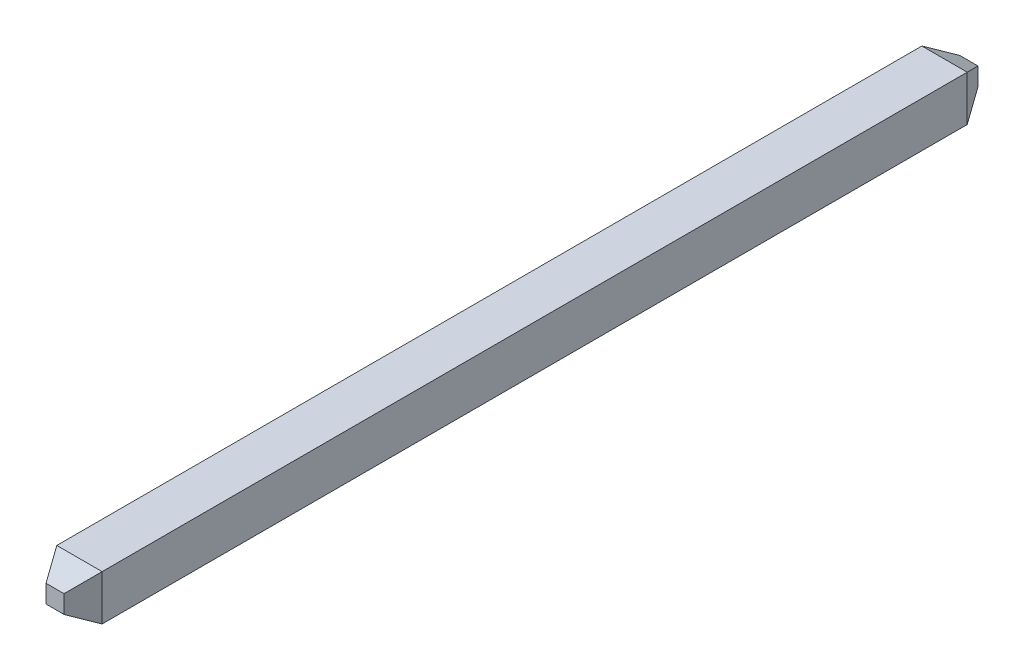
ISO-10303-21;
HEADER;
FILE_DESCRIPTION(('STEP AP214'),'2;1');
FILE_NAME('part.step','',(''),(''),'','','');
FILE_SCHEMA(('AUTOMOTIVE_DESIGN { 1 0 10303 214 1 1 1 1 }'));
ENDSEC;
DATA;
#1=APPLICATION_CONTEXT('core data for automotive mechanical design processes');
#2=APPLICATION_PROTOCOL_DEFINITION('international standard','automotive_design',2000,#1);
#3=PRODUCT_CONTEXT('',#1,'mechanical');
#4=PRODUCT('Part','Part','',(#3));
#5=PRODUCT_RELATED_PRODUCT_CATEGORY('part','',(#4));
#6=PRODUCT_DEFINITION_FORMATION('','',#4);
#7=PRODUCT_DEFINITION_CONTEXT('part definition',#1,'design');
#8=PRODUCT_DEFINITION('design','',#6,#7);
#9=PRODUCT_DEFINITION_SHAPE('','',#8);
#10=(LENGTH_UNIT() NAMED_UNIT(*) SI_UNIT(.MILLI.,.METRE.));
#11=(NAMED_UNIT(*) PLANE_ANGLE_UNIT() SI_UNIT($,.RADIAN.));
#12=(NAMED_UNIT(*) SI_UNIT($,.STERADIAN.) SOLID_ANGLE_UNIT());
#13=UNCERTAINTY_MEASURE_WITH_UNIT(LENGTH_MEASURE(1.E-05),#10,'distance_accuracy_value','');
#14=(GEOMETRIC_REPRESENTATION_CONTEXT(3) GLOBAL_UNCERTAINTY_ASSIGNED_CONTEXT((#13)) GLOBAL_UNIT_ASSIGNED_CONTEXT((#10,
#11,#12)) REPRESENTATION_CONTEXT('',''));
#15=CARTESIAN_POINT('',(0.,0.,0.));
#16=DIRECTION('',(0.,0.,1.));
#17=DIRECTION('',(1.,0.,0.));
#18=AXIS2_PLACEMENT_3D('',#15,#16,#17);
#19=CARTESIAN_POINT('',(2.66011510041924,0.945,-3.20872569516347));
#20=DIRECTION('',(0.872569516347454,0.,-0.488489958076081));
#21=DIRECTION('',(-0.488489958076081,0.,-0.872569516347454));
#22=AXIS2_PLACEMENT_3D('',#19,#20,#21);
#23=PLANE('',#22);
#24=DIRECTION('',(0.,1.,0.));
#25=VECTOR('',#24,1.);
#26=CARTESIAN_POINT('',(2.85534185664468,0.944999999999999,-2.86000017186176));
#27=LINE('',#26,#25);
#28=CARTESIAN_POINT('',(2.85534185663262,0.954999975315067,-2.85999984563027));
#29=VERTEX_POINT('',#28);
#30=CARTESIAN_POINT('',(2.85534201729186,1.58500016035866,-2.8599998849043));
#31=VERTEX_POINT('',#30);
#32=EDGE_CURVE('E146',#29,#31,#27,.T.);
#33=ORIENTED_EDGE('',*,*,#32,.F.);
#34=DIRECTION('',(0.439072617568647,-0.438284036988111,0.784297353956279));
#35=VECTOR('',#34,1.);
#36=CARTESIAN_POINT('',(2.665,1.145,-3.2));
#37=LINE('',#36,#35);
#38=CARTESIAN_POINT('',(2.665,1.145,-3.2));
#39=VERTEX_POINT('',#38);
#40=EDGE_CURVE('E143',#39,#29,#37,.T.);
#41=ORIENTED_EDGE('',*,*,#40,.F.);
#42=DIRECTION('',(0.,1.,0.));
#43=VECTOR('',#42,1.);
#44=CARTESIAN_POINT('',(2.665,1.135,-3.2));
#45=LINE('',#44,#43);
#46=CARTESIAN_POINT('',(2.665,1.395,-3.2));
#47=VERTEX_POINT('',#46);
#48=EDGE_CURVE('E95',#47,#39,#45,.F.);
#49=ORIENTED_EDGE('',*,*,#48,.F.);
#50=DIRECTION('',(-0.439072617568647,-0.438284036988111,-0.784297353956279));
#51=VECTOR('',#50,1.);
#52=CARTESIAN_POINT('',(2.85534185664468,1.585,-2.86000017186176));
#53=LINE('',#52,#51);
#54=EDGE_CURVE('E135',#31,#47,#53,.T.);
#55=ORIENTED_EDGE('',*,*,#54,.F.);
#56=EDGE_LOOP('',(#33,#41,#49,#55));
#57=FACE_BOUND('',#56,.T.);
#58=ADVANCED_FACE('F16',(#57),#23,.T.);
#59=CARTESIAN_POINT('',(2.66036702814295,0.945,9.50441734607014));
#60=DIRECTION('',(0.873317045523297,0.,0.487152273933376));
#61=DIRECTION('',(0.487152273933376,0.,-0.873317045523297));
#62=AXIS2_PLACEMENT_3D('',#59,#60,#61);
#63=PLANE('',#62);
#64=DIRECTION('',(-0.437799852400894,0.438586917260846,0.784839349959839));
#65=VECTOR('',#64,1.);
#66=CARTESIAN_POINT('',(2.85489789955164,0.954999686828527,9.15568378706484));
#67=LINE('',#66,#65);
#68=CARTESIAN_POINT('',(2.85489765454992,0.954999891076848,9.15568368845103));
#69=VERTEX_POINT('',#68);
#70=CARTESIAN_POINT('',(2.66523855088228,1.145,9.49568417561491));
#71=VERTEX_POINT('',#70);
#72=EDGE_CURVE('E152',#69,#71,#67,.T.);
#73=ORIENTED_EDGE('',*,*,#72,.F.);
#74=DIRECTION('',(0.,1.,0.));
#75=VECTOR('',#74,1.);
#76=CARTESIAN_POINT('',(2.85489853900642,0.944999999999999,9.155683722437));
#77=LINE('',#76,#75);
#78=CARTESIAN_POINT('',(2.85489765280461,1.5850001770326,9.15568371270386));
#79=VERTEX_POINT('',#78);
#80=EDGE_CURVE('E106',#79,#69,#77,.F.);
#81=ORIENTED_EDGE('',*,*,#80,.F.);
#82=DIRECTION('',(0.437799852400903,0.438586917260844,-0.784839349959835));
#83=VECTOR('',#82,1.);
#84=CARTESIAN_POINT('',(2.66523855088228,1.395,9.49568417561491));
#85=LINE('',#84,#83);
#86=CARTESIAN_POINT('',(2.66523855088228,1.395,9.49568417561491));
#87=VERTEX_POINT('',#86);
#88=EDGE_CURVE('E101',#87,#79,#85,.T.);
#89=ORIENTED_EDGE('',*,*,#88,.F.);
#90=DIRECTION('',(0.,1.,0.));
#91=VECTOR('',#90,1.);
#92=CARTESIAN_POINT('',(2.66523855088228,1.405,9.49568417561491));
#93=LINE('',#92,#91);
#94=EDGE_CURVE('E19',#71,#87,#93,.T.);
#95=ORIENTED_EDGE('',*,*,#94,.F.);
#96=EDGE_LOOP('',(#73,#81,#89,#95));
#97=FACE_BOUND('',#96,.T.);
#98=ADVANCED_FACE('F103',(#97),#63,.T.);
#99=CARTESIAN_POINT('',(2.40523855088228,1.405,9.49568417561491));
#100=DIRECTION('',(0.,0.,1.));
#101=DIRECTION('',(1.,0.,0.));
#102=AXIS2_PLACEMENT_3D('',#99,#100,#101);
#103=PLANE('',#102);
#104=DIRECTION('',(1.,0.,0.));
#105=VECTOR('',#104,1.);
#106=CARTESIAN_POINT('',(2.2148966942376,1.395,9.49568417561491));
#107=LINE('',#106,#105);
#108=CARTESIAN_POINT('',(2.41523855088228,1.395,9.49568417561491));
#109=VERTEX_POINT('',#108);
#110=EDGE_CURVE('E111',#109,#87,#107,.T.);
#111=ORIENTED_EDGE('',*,*,#110,.F.);
#112=DIRECTION('',(0.,1.,0.));
#113=VECTOR('',#112,1.);
#114=CARTESIAN_POINT('',(2.41523855088228,0.945,9.49568417561491));
#115=LINE('',#114,#113);
#116=CARTESIAN_POINT('',(2.41523855088228,1.145,9.49568417561491));
#117=VERTEX_POINT('',#116);
#118=EDGE_CURVE('E162',#117,#109,#115,.T.);
#119=ORIENTED_EDGE('',*,*,#118,.F.);
#120=DIRECTION('',(1.,0.,0.));
#121=VECTOR('',#120,1.);
#122=CARTESIAN_POINT('',(2.2148966942376,1.145,9.49568417561491));
#123=LINE('',#122,#121);
#124=EDGE_CURVE('E116',#71,#117,#123,.F.);
#125=ORIENTED_EDGE('',*,*,#124,.F.);
#126=ORIENTED_EDGE('',*,*,#94,.T.);
#127=EDGE_LOOP('',(#111,#119,#125,#126));
#128=FACE_BOUND('',#127,.T.);
#129=ADVANCED_FACE('F113',(#128),#103,.T.);
#130=CARTESIAN_POINT('',(2.2148966942376,1.39012178454432,9.50441360938624));
#131=DIRECTION('',(0.,0.872943377132664,0.487821545567864));
#132=DIRECTION('',(0.,-0.487821545567864,0.872943377132664));
#133=AXIS2_PLACEMENT_3D('',#130,#131,#132);
#134=PLANE('',#133);
#135=DIRECTION('',(-0.439072459537935,0.438284700441641,-0.78429707167252));
#136=VECTOR('',#135,1.);
#137=CARTESIAN_POINT('',(2.41523855088228,1.395,9.49568417561491));
#138=LINE('',#137,#136);
#139=CARTESIAN_POINT('',(2.2248975037028,1.58500008247257,9.15568447138297));
#140=VERTEX_POINT('',#139);
#141=EDGE_CURVE('E121',#109,#140,#138,.T.);
#142=ORIENTED_EDGE('',*,*,#141,.F.);
#143=ORIENTED_EDGE('',*,*,#110,.T.);
#144=ORIENTED_EDGE('',*,*,#88,.T.);
#145=DIRECTION('',(1.,0.,0.));
#146=VECTOR('',#145,1.);
#147=CARTESIAN_POINT('',(2.54006658937282,1.585,9.15568497320463));
#148=LINE('',#147,#146);
#149=EDGE_CURVE('E164',#140,#79,#148,.T.);
#150=ORIENTED_EDGE('',*,*,#149,.F.);
#151=EDGE_LOOP('',(#142,#143,#144,#150));
#152=FACE_BOUND('',#151,.T.);
#153=ADVANCED_FACE('F119',(#152),#134,.T.);
#154=CARTESIAN_POINT('',(2.405,1.135,-3.2));
#155=DIRECTION('',(0.,0.,-1.));
#156=DIRECTION('',(-1.,0.,0.));
#157=AXIS2_PLACEMENT_3D('',#154,#155,#156);
#158=PLANE('',#157);
#159=ORIENTED_EDGE('',*,*,#48,.T.);
#160=DIRECTION('',(1.,0.,0.));
#161=VECTOR('',#160,1.);
#162=CARTESIAN_POINT('',(2.21534185664468,1.145,-3.2));
#163=LINE('',#162,#161);
#164=CARTESIAN_POINT('',(2.415,1.145,-3.2));
#165=VERTEX_POINT('',#164);
#166=EDGE_CURVE('E139',#165,#39,#163,.T.);
#167=ORIENTED_EDGE('',*,*,#166,.F.);
#168=DIRECTION('',(0.,1.,0.));
#169=VECTOR('',#168,1.);
#170=CARTESIAN_POINT('',(2.415,0.945,-3.2));
#171=LINE('',#170,#169);
#172=CARTESIAN_POINT('',(2.415,1.395,-3.2));
#173=VERTEX_POINT('',#172);
#174=EDGE_CURVE('E176',#173,#165,#171,.F.);
#175=ORIENTED_EDGE('',*,*,#174,.F.);
#176=DIRECTION('',(1.,0.,0.));
#177=VECTOR('',#176,1.);
#178=CARTESIAN_POINT('',(2.21534185664468,1.395,-3.2));
#179=LINE('',#178,#177);
#180=EDGE_CURVE('E129',#47,#173,#179,.F.);
#181=ORIENTED_EDGE('',*,*,#180,.F.);
#182=EDGE_LOOP('',(#159,#167,#175,#181));
#183=FACE_BOUND('',#182,.T.);
#184=ADVANCED_FACE('F229',(#183),#158,.T.);
#185=CARTESIAN_POINT('',(2.21534185664468,1.58987821545568,-2.85127073809043));
#186=DIRECTION('',(0.,0.872943377132663,-0.487821545567865));
#187=DIRECTION('',(0.,0.487821545567865,0.872943377132663));
#188=AXIS2_PLACEMENT_3D('',#185,#186,#187);
#189=PLANE('',#188);
#190=DIRECTION('',(1.,0.,0.));
#191=VECTOR('',#190,1.);
#192=CARTESIAN_POINT('',(2.54006658937282,1.585,-2.86000017186176));
#193=LINE('',#192,#191);
#194=CARTESIAN_POINT('',(2.22534144768619,1.5850007068091,-2.8599984305592));
#195=VERTEX_POINT('',#194);
#196=EDGE_CURVE('E172',#31,#195,#193,.F.);
#197=ORIENTED_EDGE('',*,*,#196,.F.);
#198=ORIENTED_EDGE('',*,*,#54,.T.);
#199=ORIENTED_EDGE('',*,*,#180,.T.);
#200=DIRECTION('',(0.437798396819592,-0.43858642908966,-0.784840434713054));
#201=VECTOR('',#200,1.);
#202=CARTESIAN_POINT('',(2.22534066407532,1.58500072063078,-2.85999803394471));
#203=LINE('',#202,#201);
#204=EDGE_CURVE('E183',#195,#173,#203,.T.);
#205=ORIENTED_EDGE('',*,*,#204,.F.);
#206=EDGE_LOOP('',(#197,#198,#199,#205));
#207=FACE_BOUND('',#206,.T.);
#208=ADVANCED_FACE('F227',(#207),#189,.T.);
#209=CARTESIAN_POINT('',(2.21534185664468,1.14987821545568,-3.20872943377133));
#210=DIRECTION('',(0.,-0.872943377132663,-0.487821545567865));
#211=DIRECTION('',(0.,0.487821545567865,-0.872943377132663));
#212=AXIS2_PLACEMENT_3D('',#209,#210,#211);
#213=PLANE('',#212);
#214=ORIENTED_EDGE('',*,*,#166,.T.);
#215=ORIENTED_EDGE('',*,*,#40,.T.);
#216=DIRECTION('',(1.,0.,0.));
#217=VECTOR('',#216,1.);
#218=CARTESIAN_POINT('',(2.21494834685547,0.955,-2.85999756200982));
#219=LINE('',#218,#217);
#220=CARTESIAN_POINT('',(2.22534198218488,0.954999729763457,-2.85999898491791));
#221=VERTEX_POINT('',#220);
#222=EDGE_CURVE('E39',#221,#29,#219,.T.);
#223=ORIENTED_EDGE('',*,*,#222,.F.);
#224=DIRECTION('',(-0.437798396819591,-0.438586429089664,0.784840434713052));
#225=VECTOR('',#224,1.);
#226=CARTESIAN_POINT('',(2.415,1.145,-3.2));
#227=LINE('',#226,#225);
#228=EDGE_CURVE('E180',#165,#221,#227,.T.);
#229=ORIENTED_EDGE('',*,*,#228,.F.);
#230=EDGE_LOOP('',(#214,#215,#223,#229));
#231=FACE_BOUND('',#230,.T.);
#232=ADVANCED_FACE('F230',(#231),#213,.T.);
#233=CARTESIAN_POINT('',(2.85534630826875,0.944999999999999,-2.98065701705514));
#234=DIRECTION('',(0.999999999319383,0.,3.68949151671631E-05));
#235=DIRECTION('',(3.68949151671631E-05,0.,-0.999999999319383));
#236=AXIS2_PLACEMENT_3D('',#233,#234,#235);
#237=PLANE('',#236);
#238=DIRECTION('',(3.69481335097372E-05,0.,-0.999999999317418));
#239=VECTOR('',#238,1.);
#240=CARTESIAN_POINT('',(2.85489789955164,1.585,9.1556837224134));
#241=LINE('',#240,#239);
#242=EDGE_CURVE('E168',#79,#31,#241,.T.);
#243=ORIENTED_EDGE('',*,*,#242,.F.);
#244=ORIENTED_EDGE('',*,*,#80,.T.);
#245=DIRECTION('',(-3.69481335097373E-05,0.,0.999999999317418));
#246=VECTOR('',#245,1.);
#247=CARTESIAN_POINT('',(2.85534185664468,0.955,-2.86000017186176));
#248=LINE('',#247,#246);
#249=EDGE_CURVE('E189',#29,#69,#248,.T.);
#250=ORIENTED_EDGE('',*,*,#249,.F.);
#251=ORIENTED_EDGE('',*,*,#32,.T.);
#252=EDGE_LOOP('',(#243,#244,#250,#251));
#253=FACE_BOUND('',#252,.T.);
#254=ADVANCED_FACE('F232',(#253),#237,.T.);
#255=CARTESIAN_POINT('',(2.2148966942376,0.950121784544321,9.14695491370534));
#256=DIRECTION('',(0.,-0.872943377132664,0.487821545567865));
#257=DIRECTION('',(0.,-0.487821545567865,-0.872943377132664));
#258=AXIS2_PLACEMENT_3D('',#255,#256,#257);
#259=PLANE('',#258);
#260=ORIENTED_EDGE('',*,*,#124,.T.);
#261=DIRECTION('',(0.439072459537931,0.438284700441657,0.784297071672513));
#262=VECTOR('',#261,1.);
#263=CARTESIAN_POINT('',(2.22489724886554,0.955000197635095,9.15568533818575));
#264=LINE('',#263,#262);
#265=CARTESIAN_POINT('',(2.22489781760237,0.955000116075707,9.15568487573228));
#266=VERTEX_POINT('',#265);
#267=EDGE_CURVE('E158',#266,#117,#264,.T.);
#268=ORIENTED_EDGE('',*,*,#267,.F.);
#269=DIRECTION('',(1.,0.,0.));
#270=VECTOR('',#269,1.);
#271=CARTESIAN_POINT('',(2.21494834685547,0.955,9.15568372241339));
#272=LINE('',#271,#270);
#273=EDGE_CURVE('E193',#69,#266,#272,.F.);
#274=ORIENTED_EDGE('',*,*,#273,.F.);
#275=ORIENTED_EDGE('',*,*,#72,.T.);
#276=EDGE_LOOP('',(#260,#268,#274,#275));
#277=FACE_BOUND('',#276,.T.);
#278=ADVANCED_FACE('F219',(#277),#259,.T.);
#279=CARTESIAN_POINT('',(2.42012345046304,0.945,9.50440987077839));
#280=DIRECTION('',(-0.872569516347453,0.,0.488489958076081));
#281=DIRECTION('',(0.488489958076081,0.,0.872569516347453));
#282=AXIS2_PLACEMENT_3D('',#279,#280,#281);
#283=PLANE('',#282);
#284=ORIENTED_EDGE('',*,*,#267,.T.);
#285=ORIENTED_EDGE('',*,*,#118,.T.);
#286=ORIENTED_EDGE('',*,*,#141,.T.);
#287=DIRECTION('',(0.,1.,0.));
#288=VECTOR('',#287,1.);
#289=CARTESIAN_POINT('',(2.22489853896028,0.945,9.15568497322818));
#290=LINE('',#289,#288);
#291=EDGE_CURVE('E197',#266,#140,#290,.T.);
#292=ORIENTED_EDGE('',*,*,#291,.F.);
#293=EDGE_LOOP('',(#284,#285,#286,#292));
#294=FACE_BOUND('',#293,.T.);
#295=ADVANCED_FACE('F222',(#294),#283,.T.);
#296=CARTESIAN_POINT('',(2.54006658937282,1.585,9.32634470275115));
#297=DIRECTION('',(0.,1.,0.));
#298=DIRECTION('',(0.,0.,1.));
#299=AXIS2_PLACEMENT_3D('',#296,#297,#298);
#300=PLANE('',#299);
#301=ORIENTED_EDGE('',*,*,#196,.T.);
#302=DIRECTION('',(-3.68949151674615E-05,0.,0.999999999319383));
#303=VECTOR('',#302,1.);
#304=CARTESIAN_POINT('',(2.22489224235438,1.5849998023649,9.32634821671993));
#305=LINE('',#304,#303);
#306=EDGE_CURVE('E201',#140,#195,#305,.F.);
#307=ORIENTED_EDGE('',*,*,#306,.F.);
#308=ORIENTED_EDGE('',*,*,#149,.T.);
#309=ORIENTED_EDGE('',*,*,#242,.T.);
#310=EDGE_LOOP('',(#301,#307,#308,#309));
#311=FACE_BOUND('',#310,.T.);
#312=ADVANCED_FACE('F224',(#311),#300,.T.);
#313=CARTESIAN_POINT('',(2.41987152273933,0.945,-3.20873317045523));
#314=DIRECTION('',(-0.873317045523298,0.,-0.487152273933376));
#315=DIRECTION('',(-0.487152273933376,0.,0.873317045523298));
#316=AXIS2_PLACEMENT_3D('',#313,#314,#315);
#317=PLANE('',#316);
#318=DIRECTION('',(0.,1.,0.));
#319=VECTOR('',#318,1.);
#320=CARTESIAN_POINT('',(2.22534185654839,0.945,-2.85999756199704));
#321=LINE('',#320,#319);
#322=EDGE_CURVE('E26',#195,#221,#321,.F.);
#323=ORIENTED_EDGE('',*,*,#322,.F.);
#324=ORIENTED_EDGE('',*,*,#204,.T.);
#325=ORIENTED_EDGE('',*,*,#174,.T.);
#326=ORIENTED_EDGE('',*,*,#228,.T.);
#327=EDGE_LOOP('',(#323,#324,#325,#326));
#328=FACE_BOUND('',#327,.T.);
#329=ADVANCED_FACE('F213',(#328),#317,.T.);
#330=CARTESIAN_POINT('',(2.21494834685547,0.955,3.17284922525592));
#331=DIRECTION('',(0.,-1.,0.));
#332=DIRECTION('',(0.,0.,-1.));
#333=AXIS2_PLACEMENT_3D('',#330,#331,#332);
#334=PLANE('',#333);
#335=ORIENTED_EDGE('',*,*,#249,.T.);
#336=ORIENTED_EDGE('',*,*,#273,.T.);
#337=DIRECTION('',(-3.68949151674615E-05,0.,0.999999999319383));
#338=VECTOR('',#337,1.);
#339=CARTESIAN_POINT('',(2.22489224235438,0.954999279369218,9.32634821671993));
#340=LINE('',#339,#338);
#341=EDGE_CURVE('E11',#221,#266,#340,.T.);
#342=ORIENTED_EDGE('',*,*,#341,.F.);
#343=ORIENTED_EDGE('',*,*,#222,.T.);
#344=EDGE_LOOP('',(#335,#336,#342,#343));
#345=FACE_BOUND('',#344,.T.);
#346=ADVANCED_FACE('F215',(#345),#334,.T.);
#347=CARTESIAN_POINT('',(2.22489224235438,0.945,9.32634821671993));
#348=DIRECTION('',(-0.999999999319383,0.,-3.68949151674615E-05));
#349=DIRECTION('',(-3.68949151674615E-05,0.,0.999999999319383));
#350=AXIS2_PLACEMENT_3D('',#347,#348,#349);
#351=PLANE('',#350);
#352=ORIENTED_EDGE('',*,*,#322,.T.);
#353=ORIENTED_EDGE('',*,*,#341,.T.);
#354=ORIENTED_EDGE('',*,*,#291,.T.);
#355=ORIENTED_EDGE('',*,*,#306,.T.);
#356=EDGE_LOOP('',(#352,#353,#354,#355));
#357=FACE_BOUND('',#356,.T.);
#358=ADVANCED_FACE('F209',(#357),#351,.T.);
#359=CLOSED_SHELL('',(#58,#98,#129,#153,#184,#208,#232,#254,#278,#295,#312,#329,#346,#358));
#360=MANIFOLD_SOLID_BREP('B1',#359);
#361=ADVANCED_BREP_SHAPE_REPRESENTATION('',(#18,#360),#14);
#362=SHAPE_DEFINITION_REPRESENTATION(#9,#361);
ENDSEC;
END-ISO-10303-21;
